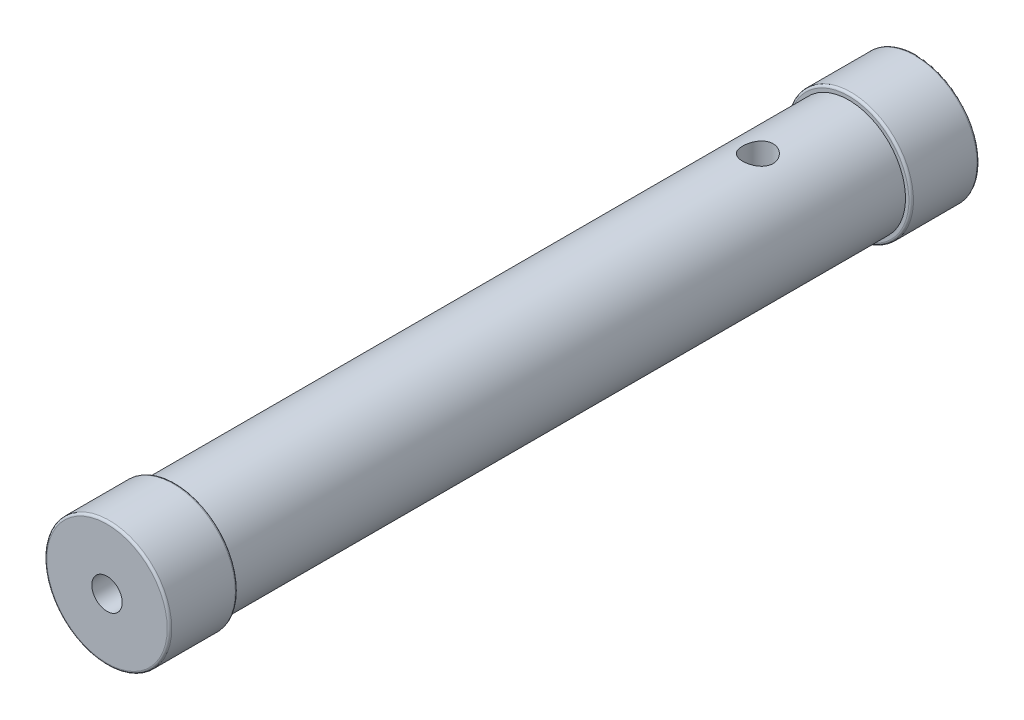
ISO-10303-21;
HEADER;
FILE_DESCRIPTION(('STEP AP214'),'2;1');
FILE_NAME('part.step','',(''),(''),'','','');
FILE_SCHEMA(('AUTOMOTIVE_DESIGN { 1 0 10303 214 1 1 1 1 }'));
ENDSEC;
DATA;
#1=APPLICATION_CONTEXT('core data for automotive mechanical design processes');
#2=APPLICATION_PROTOCOL_DEFINITION('international standard','automotive_design',2000,#1);
#3=PRODUCT_CONTEXT('',#1,'mechanical');
#4=PRODUCT('Part','Part','',(#3));
#5=PRODUCT_RELATED_PRODUCT_CATEGORY('part','',(#4));
#6=PRODUCT_DEFINITION_FORMATION('','',#4);
#7=PRODUCT_DEFINITION_CONTEXT('part definition',#1,'design');
#8=PRODUCT_DEFINITION('design','',#6,#7);
#9=PRODUCT_DEFINITION_SHAPE('','',#8);
#10=(LENGTH_UNIT() NAMED_UNIT(*) SI_UNIT(.MILLI.,.METRE.));
#11=(NAMED_UNIT(*) PLANE_ANGLE_UNIT() SI_UNIT($,.RADIAN.));
#12=(NAMED_UNIT(*) SI_UNIT($,.STERADIAN.) SOLID_ANGLE_UNIT());
#13=UNCERTAINTY_MEASURE_WITH_UNIT(LENGTH_MEASURE(1.E-05),#10,'distance_accuracy_value','');
#14=(GEOMETRIC_REPRESENTATION_CONTEXT(3) GLOBAL_UNCERTAINTY_ASSIGNED_CONTEXT((#13)) GLOBAL_UNIT_ASSIGNED_CONTEXT((#10,
#11,#12)) REPRESENTATION_CONTEXT('',''));
#15=CARTESIAN_POINT('',(0.,0.,0.));
#16=DIRECTION('',(0.,0.,1.));
#17=DIRECTION('',(1.,0.,0.));
#18=AXIS2_PLACEMENT_3D('',#15,#16,#17);
#19=CARTESIAN_POINT('',(0.,0.,356.5));
#20=DIRECTION('',(0.,0.,-1.));
#21=DIRECTION('',(-1.,0.,0.));
#22=AXIS2_PLACEMENT_3D('',#19,#20,#21);
#23=CYLINDRICAL_SURFACE('',#22,25.);
#24=CARTESIAN_POINT('',(0.,25.,76.7));
#25=CARTESIAN_POINT('',(-0.184700398279364,25.0000040720988,76.700006393712));
#26=CARTESIAN_POINT('',(-0.369334451472313,24.9979503284921,76.6923617389128));
#27=CARTESIAN_POINT('',(-0.737303476695323,24.9898016962233,76.6618642772237));
#28=CARTESIAN_POINT('',(-0.920638328865239,24.983706439486,76.6390100851454));
#29=CARTESIAN_POINT('',(-1.28466077898197,24.9676364441812,76.5782761663218));
#30=CARTESIAN_POINT('',(-1.46534776730316,24.9576608263476,76.5403930340721));
#31=CARTESIAN_POINT('',(-1.82282776438892,24.9341010354583,76.4499072578912));
#32=CARTESIAN_POINT('',(-1.99961931043949,24.9205155311015,76.3972991831206));
#33=CARTESIAN_POINT('',(-2.34772058974933,24.8901322850517,76.2778984834367));
#34=CARTESIAN_POINT('',(-2.51903910060402,24.873340023028,76.2111300343876));
#35=CARTESIAN_POINT('',(-2.85542584730583,24.836972051365,76.0638496614044));
#36=CARTESIAN_POINT('',(-3.02049174502907,24.8173953132501,75.9833326570831));
#37=CARTESIAN_POINT('',(-3.34319595911951,24.7759860880985,75.8091852596538));
#38=CARTESIAN_POINT('',(-3.50083673933327,24.754154357115,75.7155592580062));
#39=CARTESIAN_POINT('',(-3.80777974270735,24.708802743683,75.5158309120711));
#40=CARTESIAN_POINT('',(-3.95707874617589,24.6852822173019,75.4097237988255));
#41=CARTESIAN_POINT('',(-4.39699015505903,24.6121069470767,75.069091876205));
#42=CARTESIAN_POINT('',(-4.67309178126308,24.5607117336681,74.8157753436156));
#43=CARTESIAN_POINT('',(-5.17938418575683,24.4589651055811,74.2665546063954));
#44=CARTESIAN_POINT('',(-5.4095689906475,24.4086138274723,73.97064486935));
#45=CARTESIAN_POINT('',(-5.71746588757256,24.3376648683563,73.4981265668985));
#46=CARTESIAN_POINT('',(-5.81456743691813,24.3145919450013,73.3342361656786));
#47=CARTESIAN_POINT('',(-5.99456965401867,24.2708408632793,72.9985579415977));
#48=CARTESIAN_POINT('',(-6.07747588059889,24.2501617685319,72.826773243688));
#49=CARTESIAN_POINT('',(-6.22845655741341,24.2118236100558,72.4764358640483));
#50=CARTESIAN_POINT('',(-6.29652720215178,24.1941653214475,72.2978814595676));
#51=CARTESIAN_POINT('',(-6.41722109399713,24.1624330314738,71.9353920107844));
#52=CARTESIAN_POINT('',(-6.46985086999786,24.1483575155317,71.7514592768941));
#53=CARTESIAN_POINT('',(-6.55822942292211,24.1245036476564,71.3836869967675));
#54=CARTESIAN_POINT('',(-6.59433014685934,24.1146360462004,71.1999377767623));
#55=CARTESIAN_POINT('',(-6.65102828679536,24.0990599329375,70.8299587652205));
#56=CARTESIAN_POINT('',(-6.6716317810871,24.0933497905284,70.6437299754135));
#57=CARTESIAN_POINT('',(-6.697171050573,24.0862632304189,70.2701140201589));
#58=CARTESIAN_POINT('',(-6.70210643718457,24.0848869202013,70.0827268260974));
#59=CARTESIAN_POINT('',(-6.69626272106313,24.0865123111059,69.7082183979115));
#60=CARTESIAN_POINT('',(-6.68548387580273,24.0895139404971,69.5210971594798));
#61=CARTESIAN_POINT('',(-6.64884046550414,24.0996528392488,69.1538283290269));
#62=CARTESIAN_POINT('',(-6.62341300384836,24.1066702422553,68.9736336041696));
#63=CARTESIAN_POINT('',(-6.55802410816618,24.1245407695626,68.6160312187923));
#64=CARTESIAN_POINT('',(-6.51805770068844,24.1353952063918,68.4386245336886));
#65=CARTESIAN_POINT('',(-6.42393604384064,24.1606170298055,68.0879336690639));
#66=CARTESIAN_POINT('',(-6.36978513832381,24.1749833408257,67.9146482451407));
#67=CARTESIAN_POINT('',(-6.24769311060472,24.2068235977316,67.5732300096728));
#68=CARTESIAN_POINT('',(-6.17974680637353,24.2242987110846,67.4050991617621));
#69=CARTESIAN_POINT('',(-6.02976416787844,24.2620688823696,67.0733208338898));
#70=CARTESIAN_POINT('',(-5.94758106365839,24.2823928454214,66.9097430155415));
#71=CARTESIAN_POINT('',(-5.77021743588375,24.3251497619329,66.5900109638037));
#72=CARTESIAN_POINT('',(-5.67503244323203,24.3475834397284,66.4338593079746));
#73=CARTESIAN_POINT('',(-5.47233996912001,24.3939398062499,66.1300067300459));
#74=CARTESIAN_POINT('',(-5.36483254633806,24.4178624878851,65.98230576771));
#75=CARTESIAN_POINT('',(-5.13819700481798,24.4665559933736,65.6962538372849));
#76=CARTESIAN_POINT('',(-5.01906862605122,24.4913268361971,65.5579030785318));
#77=CARTESIAN_POINT('',(-4.76580622844742,24.5418888598484,65.2869748265201));
#78=CARTESIAN_POINT('',(-4.63130553183596,24.5676866301811,65.1547410770855));
#79=CARTESIAN_POINT('',(-4.35163118805883,24.6187632101253,64.9020779485146));
#80=CARTESIAN_POINT('',(-4.20646106513268,24.6440421876023,64.781644701926));
#81=CARTESIAN_POINT('',(-3.90628969098756,24.6934007456147,64.5533060635643));
#82=CARTESIAN_POINT('',(-3.75128436784584,24.7174798219094,64.4454059137089));
#83=CARTESIAN_POINT('',(-3.43257741561793,24.7637502545993,64.2430013654609));
#84=CARTESIAN_POINT('',(-3.2688791985992,24.7859423428926,64.148491763769));
#85=CARTESIAN_POINT('',(-2.93301389497084,24.8279319532666,63.9731024980498));
#86=CARTESIAN_POINT('',(-2.76080960008206,24.8477173454324,63.8922911303029));
#87=CARTESIAN_POINT('',(-2.40993700621777,24.8841977548536,63.7455335134102));
#88=CARTESIAN_POINT('',(-2.23127119459351,24.9008939464685,63.6795816133537));
#89=CARTESIAN_POINT('',(-1.86869710315141,24.9307251321014,63.5630573758879));
#90=CARTESIAN_POINT('',(-1.68478874864579,24.9438600753562,63.5124852577063));
#91=CARTESIAN_POINT('',(-1.31310253938385,24.9661854848872,63.42716835235));
#92=CARTESIAN_POINT('',(-1.1253247954901,24.97537606401,63.3924231123739));
#93=CARTESIAN_POINT('',(-0.752881901105318,24.9893351849549,63.3398577600791));
#94=CARTESIAN_POINT('',(-0.568287057891064,24.9942255504071,63.3215710026981));
#95=CARTESIAN_POINT('',(-0.198087235049676,24.9999008090489,63.3003622294096));
#96=CARTESIAN_POINT('',(-0.0124819275135959,25.0006842788278,63.2974455406187));
#97=CARTESIAN_POINT('',(0.358214908069406,24.9981203940095,63.3070153245491));
#98=CARTESIAN_POINT('',(0.543306635120264,24.9947749628491,63.3194946250909));
#99=CARTESIAN_POINT('',(0.911771099248296,24.9840480404169,63.3597415532902));
#100=CARTESIAN_POINT('',(1.09514317576283,24.9766650580054,63.3875148293118));
#101=CARTESIAN_POINT('',(1.45552977273023,24.9582333378258,63.4574831454733));
#102=CARTESIAN_POINT('',(1.63259936056688,24.9472521313114,63.4994129076726));
#103=CARTESIAN_POINT('',(1.98258001909425,24.9218813889187,63.5974681648232));
#104=CARTESIAN_POINT('',(2.15548957263592,24.9074906297385,63.6535987553336));
#105=CARTESIAN_POINT('',(2.49588592882454,24.8756863074903,63.7795915482038));
#106=CARTESIAN_POINT('',(2.66337421772654,24.8582735813755,63.8494499492653));
#107=CARTESIAN_POINT('',(2.99195779707744,24.8208691226753,64.002413576052));
#108=CARTESIAN_POINT('',(3.15305078778313,24.8008764731423,64.0855235140802));
#109=CARTESIAN_POINT('',(3.47085366910557,24.758420328352,64.2661331593526));
#110=CARTESIAN_POINT('',(3.6274163215964,24.7359161727212,64.3638823992054));
#111=CARTESIAN_POINT('',(3.9317964949485,24.6893638122867,64.5718371635367));
#112=CARTESIAN_POINT('',(4.07961379406798,24.6653155683643,64.6820430036511));
#113=CARTESIAN_POINT('',(4.36562716946965,24.6163027602544,64.9142122344012));
#114=CARTESIAN_POINT('',(4.50381999557972,24.5913378908286,65.0361795640374));
#115=CARTESIAN_POINT('',(4.76962534117674,24.5411687782452,65.2910125918579));
#116=CARTESIAN_POINT('',(4.8972412607777,24.5159646149391,65.4238747601866));
#117=CARTESIAN_POINT('',(5.14466800890223,24.4652570049811,65.7036911632353));
#118=CARTESIAN_POINT('',(5.26414647254304,24.4397659759511,65.8509417802315));
#119=CARTESIAN_POINT('',(5.49024015420077,24.3899705406741,66.1551124927217));
#120=CARTESIAN_POINT('',(5.59686001922046,24.3656657076466,66.3120290638513));
#121=CARTESIAN_POINT('',(5.79655995326237,24.3189312548554,66.6346042694545));
#122=CARTESIAN_POINT('',(5.88963500896428,24.2965023307188,66.8002661100419));
#123=CARTESIAN_POINT('',(6.06145802824069,24.2542069866262,67.139092403857));
#124=CARTESIAN_POINT('',(6.14021179829006,24.2343395290948,67.312253781028));
#125=CARTESIAN_POINT('',(6.28241871126045,24.1978630982411,67.6639774837481));
#126=CARTESIAN_POINT('',(6.34595280305107,24.1812369774326,67.8425052814424));
#127=CARTESIAN_POINT('',(6.4577155041855,24.1516304926587,68.2045113028312));
#128=CARTESIAN_POINT('',(6.50595008311741,24.1386487069687,68.3879875653312));
#129=CARTESIAN_POINT('',(6.58672096892668,24.1167340469047,68.7585996143771));
#130=CARTESIAN_POINT('',(6.61925762353519,24.1078010828439,68.9457353197655));
#131=CARTESIAN_POINT('',(6.66833482441991,24.0942723885285,69.3222465113918));
#132=CARTESIAN_POINT('',(6.68487582775746,24.089676534345,69.5116219334753));
#133=CARTESIAN_POINT('',(6.70152598038224,24.0850496914148,69.884816511595));
#134=CARTESIAN_POINT('',(6.7021645405981,24.0848716299475,70.0686104310687));
#135=CARTESIAN_POINT('',(6.68834408132313,24.08871323617,70.435650264814));
#136=CARTESIAN_POINT('',(6.67387987057909,24.0927343472353,70.6188959689291));
#137=CARTESIAN_POINT('',(6.62998184626829,24.1048513124306,70.9833722431411));
#138=CARTESIAN_POINT('',(6.60055402225761,24.1129455361833,71.1646035898976));
#139=CARTESIAN_POINT('',(6.52697147302902,24.1329669785103,71.5239042444901));
#140=CARTESIAN_POINT('',(6.48281126005915,24.1448956253305,71.7019723479598));
#141=CARTESIAN_POINT('',(6.38055912538605,24.1721169332805,72.0521859594746));
#142=CARTESIAN_POINT('',(6.32258551922374,24.1873809387301,72.2243682850425));
#143=CARTESIAN_POINT('',(6.19294807433535,24.2208974738671,72.563263579763));
#144=CARTESIAN_POINT('',(6.12127957215128,24.2391510212655,72.7299746630946));
#145=CARTESIAN_POINT('',(5.96479968163694,24.2781313468793,73.0567937158583));
#146=CARTESIAN_POINT('',(5.87998903955819,24.2988579846496,73.2169020595612));
#147=CARTESIAN_POINT('',(5.69781368404997,24.3422201705243,73.5295402690557));
#148=CARTESIAN_POINT('',(5.60044857425744,24.36485577889,73.6820698953654));
#149=CARTESIAN_POINT('',(5.39072188235647,24.4121283608373,73.9830590063949));
#150=CARTESIAN_POINT('',(5.27799917198776,24.4368049231737,74.1312607483058));
#151=CARTESIAN_POINT('',(5.04072050217011,24.4868501354198,74.4176587324611));
#152=CARTESIAN_POINT('',(4.91616825606724,24.512218566378,74.5558580906552));
#153=CARTESIAN_POINT('',(4.65593212167185,24.5629777588492,74.8215026451356));
#154=CARTESIAN_POINT('',(4.52024181146898,24.5883685247752,74.9489415501097));
#155=CARTESIAN_POINT('',(4.23870925670936,24.6384613161874,75.1921025869148));
#156=CARTESIAN_POINT('',(4.09287068718405,24.6631635865093,75.3078289233866));
#157=CARTESIAN_POINT('',(3.78859174937896,24.7117547511862,75.529263243397));
#158=CARTESIAN_POINT('',(3.62994409371068,24.7356135999423,75.6346932584951));
#159=CARTESIAN_POINT('',(3.30408889728364,24.7812439990952,75.8317441342591));
#160=CARTESIAN_POINT('',(3.13688452584755,24.8030163138621,75.9233700589347));
#161=CARTESIAN_POINT('',(2.79505618587902,24.8438575005938,76.0921232480192));
#162=CARTESIAN_POINT('',(2.62043487947401,24.8629273320681,76.1692556614965));
#163=CARTESIAN_POINT('',(2.26502150555481,24.8978234248941,76.308417034252));
#164=CARTESIAN_POINT('',(2.08423026157792,24.9136501171664,76.3704480002877));
#165=CARTESIAN_POINT('',(1.59352340845748,24.9510605627595,76.5156206370486));
#166=CARTESIAN_POINT('',(1.27903929447815,24.9692898002586,76.5846308294629));
#167=CARTESIAN_POINT('',(0.642969349294276,24.9937553710297,76.6768126356769));
#168=CARTESIAN_POINT('',(0.321384237989599,24.9999929144258,76.6999888747492));
#169=CARTESIAN_POINT('',(0.,25.,76.7));
#170=B_SPLINE_CURVE_WITH_KNOTS('',3,(#24,#25,#26,#27,#28,#29,#30,#31,#32,#33,#34,#35,#36,#37,
#38,#39,#40,#41,#42,#43,#44,#45,#46,#47,#48,#49,#50,#51,#52,#53,#54,#55,#56,#57,#58,#59,#60,#61,
#62,#63,#64,#65,#66,#67,#68,#69,#70,#71,#72,#73,#74,#75,#76,#77,#78,#79,#80,#81,#82,#83,#84,#85,
#86,#87,#88,#89,#90,#91,#92,#93,#94,#95,#96,#97,#98,#99,#100,#101,#102,#103,#104,#105,#106,#107,
#108,#109,#110,#111,#112,#113,#114,#115,#116,#117,#118,#119,#120,#121,#122,#123,#124,#125,#126,
#127,#128,#129,#130,#131,#132,#133,#134,#135,#136,#137,#138,#139,#140,#141,#142,#143,#144,#145,
#146,#147,#148,#149,#150,#151,#152,#153,#154,#155,#156,#157,#158,#159,#160,#161,#162,#163,#164,
#165,#166,#167,#168,#169),.UNSPECIFIED.,.T.,.F.,(4,2,2,2,2,2,2,2,2,2,2,2,2,2,2,2,2,2,2,2,2,2,2,
2,2,2,2,2,2,2,2,2,2,2,2,2,2,2,2,2,2,2,2,2,2,2,2,2,2,2,2,2,2,2,2,2,2,2,2,2,2,2,2,2,2,2,2,2,2,2,2,
2,4),(0.,0.553817557783857,1.10768556067305,1.66167913983917,2.21587731224757,2.76913681687448,
3.3226012069867,3.87588063043373,4.42937214958944,5.55847821711456,6.6877310763517,
7.26280556151458,7.83765433245224,8.41265038555795,8.98740296036032,9.54927236457848,
10.1109212784029,10.6725841214957,11.2342377620276,11.7799413280824,12.325831743048,
12.8715551798667,13.4174839898091,13.9694180655797,14.5215423355123,15.0736639763858,
15.6257979742786,16.1962471556127,16.7665087503249,17.3370080023358,17.9072849581595,
18.4803265019407,19.0531497543997,19.6259811716552,20.1987961993716,20.7548059209666,
21.3110083374632,21.8669517463913,22.4231006139223,22.9693583014592,23.5158122765612,
24.0621151485478,24.6086127232152,25.1657932190881,25.7229878364364,26.2803697143534,
26.8375717123967,27.4108846158146,27.9839897033361,28.5573063768122,29.1303900818679,
29.7003544631559,30.2700961804926,30.8398252766678,31.4095380928662,31.9602582016445,
32.5111676709703,33.0618567985472,33.6127512849372,34.1590868657336,34.7056088202009,
35.2520997528183,35.7986079431863,36.361443573716,36.9241031078157,37.4870893663393,
38.0498727987811,38.6250952675526,39.2001062002889,39.7749124626904,40.3496423001566,
41.3133987383052,42.2770579152844),.UNSPECIFIED.);
#171=CARTESIAN_POINT('',(0.,25.,76.7));
#172=VERTEX_POINT('',#171);
#173=EDGE_CURVE('E83',#172,#172,#170,.T.);
#174=ORIENTED_EDGE('',*,*,#173,.T.);
#175=EDGE_LOOP('',(#174));
#176=FACE_BOUND('',#175,.T.);
#177=CARTESIAN_POINT('',(0.,0.,326.5));
#178=DIRECTION('',(0.,0.,1.));
#179=DIRECTION('',(1.,0.,0.));
#180=AXIS2_PLACEMENT_3D('',#177,#178,#179);
#181=CIRCLE('',#180,25.);
#182=CARTESIAN_POINT('',(25.,0.,326.5));
#183=VERTEX_POINT('',#182);
#184=EDGE_CURVE('E153',#183,#183,#181,.T.);
#185=ORIENTED_EDGE('',*,*,#184,.F.);
#186=EDGE_LOOP('',(#185));
#187=FACE_BOUND('',#186,.T.);
#188=CARTESIAN_POINT('',(0.,0.,30.));
#189=DIRECTION('',(0.,0.,-1.));
#190=DIRECTION('',(-1.,0.,0.));
#191=AXIS2_PLACEMENT_3D('',#188,#189,#190);
#192=CIRCLE('',#191,25.);
#193=CARTESIAN_POINT('',(-25.,0.,30.));
#194=VERTEX_POINT('',#193);
#195=EDGE_CURVE('E92',#194,#194,#192,.T.);
#196=ORIENTED_EDGE('',*,*,#195,.F.);
#197=EDGE_LOOP('',(#196));
#198=FACE_BOUND('',#197,.T.);
#199=ADVANCED_FACE('F43',(#176,#187,#198),#23,.T.);
#200=CARTESIAN_POINT('',(0.,0.,326.5));
#201=DIRECTION('',(0.,0.,1.));
#202=DIRECTION('',(1.,0.,0.));
#203=AXIS2_PLACEMENT_3D('',#200,#201,#202);
#204=CYLINDRICAL_SURFACE('',#203,27.5);
#205=CARTESIAN_POINT('',(0.,0.,327.5));
#206=DIRECTION('',(0.,0.,1.));
#207=DIRECTION('',(1.,0.,0.));
#208=AXIS2_PLACEMENT_3D('',#205,#206,#207);
#209=CIRCLE('',#208,27.5);
#210=CARTESIAN_POINT('',(27.5,0.,327.5));
#211=VERTEX_POINT('',#210);
#212=EDGE_CURVE('E56',#211,#211,#209,.T.);
#213=ORIENTED_EDGE('',*,*,#212,.T.);
#214=EDGE_LOOP('',(#213));
#215=FACE_BOUND('',#214,.T.);
#216=CARTESIAN_POINT('',(0.,0.,355.5));
#217=DIRECTION('',(0.,0.,1.));
#218=DIRECTION('',(1.,0.,0.));
#219=AXIS2_PLACEMENT_3D('',#216,#217,#218);
#220=CIRCLE('',#219,27.5);
#221=CARTESIAN_POINT('',(27.5,0.,355.5));
#222=VERTEX_POINT('',#221);
#223=EDGE_CURVE('E61',#222,#222,#220,.F.);
#224=ORIENTED_EDGE('',*,*,#223,.T.);
#225=EDGE_LOOP('',(#224));
#226=FACE_BOUND('',#225,.T.);
#227=ADVANCED_FACE('F133',(#215,#226),#204,.T.);
#228=CARTESIAN_POINT('',(0.,0.,326.5));
#229=DIRECTION('',(0.,0.,1.));
#230=DIRECTION('',(1.,0.,0.));
#231=AXIS2_PLACEMENT_3D('',#228,#229,#230);
#232=PLANE('',#231);
#233=CARTESIAN_POINT('',(0.,0.,326.5));
#234=DIRECTION('',(0.,0.,1.));
#235=DIRECTION('',(1.,0.,0.));
#236=AXIS2_PLACEMENT_3D('',#233,#234,#235);
#237=CIRCLE('',#236,26.5);
#238=CARTESIAN_POINT('',(26.5,0.,326.5));
#239=VERTEX_POINT('',#238);
#240=EDGE_CURVE('E51',#239,#239,#237,.F.);
#241=ORIENTED_EDGE('',*,*,#240,.T.);
#242=EDGE_LOOP('',(#241));
#243=FACE_BOUND('',#242,.T.);
#244=ORIENTED_EDGE('',*,*,#184,.T.);
#245=EDGE_LOOP('',(#244));
#246=FACE_BOUND('',#245,.T.);
#247=ADVANCED_FACE('F130',(#243,#246),#232,.F.);
#248=CARTESIAN_POINT('',(0.,0.,356.5));
#249=DIRECTION('',(0.,0.,1.));
#250=DIRECTION('',(1.,0.,0.));
#251=AXIS2_PLACEMENT_3D('',#248,#249,#250);
#252=PLANE('',#251);
#253=CARTESIAN_POINT('',(0.,0.,356.5));
#254=DIRECTION('',(0.,0.,1.));
#255=DIRECTION('',(1.,0.,0.));
#256=AXIS2_PLACEMENT_3D('',#253,#254,#255);
#257=CIRCLE('',#256,26.5);
#258=CARTESIAN_POINT('',(26.5,0.,356.5));
#259=VERTEX_POINT('',#258);
#260=EDGE_CURVE('E10',#259,#259,#257,.T.);
#261=ORIENTED_EDGE('',*,*,#260,.T.);
#262=EDGE_LOOP('',(#261));
#263=FACE_BOUND('',#262,.T.);
#264=CARTESIAN_POINT('',(0.,0.,356.5));
#265=DIRECTION('',(0.,0.,1.));
#266=DIRECTION('',(1.,0.,0.));
#267=AXIS2_PLACEMENT_3D('',#264,#265,#266);
#268=CIRCLE('',#267,6.7);
#269=CARTESIAN_POINT('',(6.7,0.,356.5));
#270=VERTEX_POINT('',#269);
#271=EDGE_CURVE('E170',#270,#270,#268,.T.);
#272=ORIENTED_EDGE('',*,*,#271,.F.);
#273=EDGE_LOOP('',(#272));
#274=FACE_BOUND('',#273,.T.);
#275=ADVANCED_FACE('F128',(#263,#274),#252,.T.);
#276=CARTESIAN_POINT('',(0.,0.,30.));
#277=DIRECTION('',(0.,0.,-1.));
#278=DIRECTION('',(-1.,0.,0.));
#279=AXIS2_PLACEMENT_3D('',#276,#277,#278);
#280=CYLINDRICAL_SURFACE('',#279,27.5);
#281=CARTESIAN_POINT('',(0.,0.,29.));
#282=DIRECTION('',(0.,0.,-1.));
#283=DIRECTION('',(-1.,0.,0.));
#284=AXIS2_PLACEMENT_3D('',#281,#282,#283);
#285=CIRCLE('',#284,27.5);
#286=CARTESIAN_POINT('',(-27.5,0.,29.));
#287=VERTEX_POINT('',#286);
#288=EDGE_CURVE('E75',#287,#287,#285,.T.);
#289=ORIENTED_EDGE('',*,*,#288,.T.);
#290=EDGE_LOOP('',(#289));
#291=FACE_BOUND('',#290,.T.);
#292=CARTESIAN_POINT('',(0.,0.,1.));
#293=DIRECTION('',(0.,0.,1.));
#294=DIRECTION('',(1.,0.,0.));
#295=AXIS2_PLACEMENT_3D('',#292,#293,#294);
#296=CIRCLE('',#295,27.5);
#297=CARTESIAN_POINT('',(27.5,0.,1.));
#298=VERTEX_POINT('',#297);
#299=EDGE_CURVE('E79',#298,#298,#296,.T.);
#300=ORIENTED_EDGE('',*,*,#299,.T.);
#301=EDGE_LOOP('',(#300));
#302=FACE_BOUND('',#301,.T.);
#303=ADVANCED_FACE('F124',(#291,#302),#280,.T.);
#304=CARTESIAN_POINT('',(0.,0.,30.));
#305=DIRECTION('',(0.,0.,-1.));
#306=DIRECTION('',(-1.,0.,0.));
#307=AXIS2_PLACEMENT_3D('',#304,#305,#306);
#308=PLANE('',#307);
#309=CARTESIAN_POINT('',(0.,0.,30.));
#310=DIRECTION('',(0.,0.,-1.));
#311=DIRECTION('',(-1.,0.,0.));
#312=AXIS2_PLACEMENT_3D('',#309,#310,#311);
#313=CIRCLE('',#312,26.5);
#314=CARTESIAN_POINT('',(-26.5,0.,30.));
#315=VERTEX_POINT('',#314);
#316=EDGE_CURVE('E71',#315,#315,#313,.F.);
#317=ORIENTED_EDGE('',*,*,#316,.T.);
#318=EDGE_LOOP('',(#317));
#319=FACE_BOUND('',#318,.T.);
#320=ORIENTED_EDGE('',*,*,#195,.T.);
#321=EDGE_LOOP('',(#320));
#322=FACE_BOUND('',#321,.T.);
#323=ADVANCED_FACE('F121',(#319,#322),#308,.F.);
#324=CARTESIAN_POINT('',(0.,0.,0.));
#325=DIRECTION('',(0.,0.,1.));
#326=DIRECTION('',(1.,0.,0.));
#327=AXIS2_PLACEMENT_3D('',#324,#325,#326);
#328=PLANE('',#327);
#329=CARTESIAN_POINT('',(0.,0.,0.));
#330=DIRECTION('',(0.,0.,1.));
#331=DIRECTION('',(1.,0.,0.));
#332=AXIS2_PLACEMENT_3D('',#329,#330,#331);
#333=CIRCLE('',#332,26.5);
#334=CARTESIAN_POINT('',(26.5,0.,0.));
#335=VERTEX_POINT('',#334);
#336=EDGE_CURVE('E67',#335,#335,#333,.F.);
#337=ORIENTED_EDGE('',*,*,#336,.T.);
#338=EDGE_LOOP('',(#337));
#339=FACE_BOUND('',#338,.T.);
#340=CARTESIAN_POINT('',(0.,0.,0.));
#341=DIRECTION('',(0.,0.,-1.));
#342=DIRECTION('',(-1.,0.,0.));
#343=AXIS2_PLACEMENT_3D('',#340,#341,#342);
#344=CIRCLE('',#343,6.7);
#345=CARTESIAN_POINT('',(-6.7,0.,0.));
#346=VERTEX_POINT('',#345);
#347=EDGE_CURVE('E163',#346,#346,#344,.T.);
#348=ORIENTED_EDGE('',*,*,#347,.F.);
#349=EDGE_LOOP('',(#348));
#350=FACE_BOUND('',#349,.T.);
#351=ADVANCED_FACE('F119',(#339,#350),#328,.F.);
#352=CARTESIAN_POINT('',(0.,0.,20.));
#353=DIRECTION('',(0.,0.,-1.));
#354=DIRECTION('',(-1.,0.,0.));
#355=AXIS2_PLACEMENT_3D('',#352,#353,#354);
#356=CYLINDRICAL_SURFACE('',#355,6.7);
#357=CARTESIAN_POINT('',(0.,0.,20.));
#358=DIRECTION('',(0.,0.,-1.));
#359=DIRECTION('',(-1.,0.,0.));
#360=AXIS2_PLACEMENT_3D('',#357,#358,#359);
#361=CIRCLE('',#360,6.7);
#362=CARTESIAN_POINT('',(-6.7,0.,20.));
#363=VERTEX_POINT('',#362);
#364=EDGE_CURVE('E159',#363,#363,#361,.T.);
#365=ORIENTED_EDGE('',*,*,#364,.F.);
#366=EDGE_LOOP('',(#365));
#367=FACE_BOUND('',#366,.T.);
#368=ORIENTED_EDGE('',*,*,#347,.T.);
#369=EDGE_LOOP('',(#368));
#370=FACE_BOUND('',#369,.T.);
#371=ADVANCED_FACE('F115',(#367,#370),#356,.F.);
#372=CARTESIAN_POINT('',(0.,0.,20.));
#373=DIRECTION('',(0.,0.,-1.));
#374=DIRECTION('',(-1.,0.,0.));
#375=AXIS2_PLACEMENT_3D('',#372,#373,#374);
#376=PLANE('',#375);
#377=ORIENTED_EDGE('',*,*,#364,.T.);
#378=EDGE_LOOP('',(#377));
#379=FACE_BOUND('',#378,.T.);
#380=ADVANCED_FACE('F111',(#379),#376,.T.);
#381=CARTESIAN_POINT('',(0.,0.,336.5));
#382=DIRECTION('',(0.,0.,1.));
#383=DIRECTION('',(1.,0.,0.));
#384=AXIS2_PLACEMENT_3D('',#381,#382,#383);
#385=CYLINDRICAL_SURFACE('',#384,6.7);
#386=CARTESIAN_POINT('',(0.,0.,336.5));
#387=DIRECTION('',(0.,0.,1.));
#388=DIRECTION('',(1.,0.,0.));
#389=AXIS2_PLACEMENT_3D('',#386,#387,#388);
#390=CIRCLE('',#389,6.7);
#391=CARTESIAN_POINT('',(6.7,0.,336.5));
#392=VERTEX_POINT('',#391);
#393=EDGE_CURVE('E168',#392,#392,#390,.T.);
#394=ORIENTED_EDGE('',*,*,#393,.F.);
#395=EDGE_LOOP('',(#394));
#396=FACE_BOUND('',#395,.T.);
#397=ORIENTED_EDGE('',*,*,#271,.T.);
#398=EDGE_LOOP('',(#397));
#399=FACE_BOUND('',#398,.T.);
#400=ADVANCED_FACE('F107',(#396,#399),#385,.F.);
#401=CARTESIAN_POINT('',(0.,0.,336.5));
#402=DIRECTION('',(0.,0.,1.));
#403=DIRECTION('',(1.,0.,0.));
#404=AXIS2_PLACEMENT_3D('',#401,#402,#403);
#405=PLANE('',#404);
#406=ORIENTED_EDGE('',*,*,#393,.T.);
#407=EDGE_LOOP('',(#406));
#408=FACE_BOUND('',#407,.T.);
#409=ADVANCED_FACE('F103',(#408),#405,.T.);
#410=CARTESIAN_POINT('',(0.,5.,70.));
#411=DIRECTION('',(0.,1.,0.));
#412=DIRECTION('',(0.,0.,1.));
#413=AXIS2_PLACEMENT_3D('',#410,#411,#412);
#414=CYLINDRICAL_SURFACE('',#413,6.7);
#415=CARTESIAN_POINT('',(0.,5.,70.));
#416=DIRECTION('',(0.,1.,0.));
#417=DIRECTION('',(0.,0.,1.));
#418=AXIS2_PLACEMENT_3D('',#415,#416,#417);
#419=CIRCLE('',#418,6.7);
#420=CARTESIAN_POINT('',(0.,5.,76.7));
#421=VERTEX_POINT('',#420);
#422=EDGE_CURVE('E174',#421,#421,#419,.T.);
#423=ORIENTED_EDGE('',*,*,#422,.F.);
#424=EDGE_LOOP('',(#423));
#425=FACE_BOUND('',#424,.T.);
#426=ORIENTED_EDGE('',*,*,#173,.F.);
#427=EDGE_LOOP('',(#426));
#428=FACE_BOUND('',#427,.T.);
#429=ADVANCED_FACE('F97',(#425,#428),#414,.F.);
#430=CARTESIAN_POINT('',(0.,5.,70.));
#431=DIRECTION('',(0.,1.,0.));
#432=DIRECTION('',(0.,0.,1.));
#433=AXIS2_PLACEMENT_3D('',#430,#431,#432);
#434=PLANE('',#433);
#435=ORIENTED_EDGE('',*,*,#422,.T.);
#436=EDGE_LOOP('',(#435));
#437=FACE_BOUND('',#436,.T.);
#438=ADVANCED_FACE('F102',(#437),#434,.T.);
#439=CARTESIAN_POINT('',(0.,0.,29.));
#440=DIRECTION('',(0.,0.,-1.));
#441=DIRECTION('',(-1.,0.,0.));
#442=AXIS2_PLACEMENT_3D('',#439,#440,#441);
#443=TOROIDAL_SURFACE('',#442,26.5,1.);
#444=ORIENTED_EDGE('',*,*,#316,.F.);
#445=EDGE_LOOP('',(#444));
#446=FACE_BOUND('',#445,.T.);
#447=ORIENTED_EDGE('',*,*,#288,.F.);
#448=EDGE_LOOP('',(#447));
#449=FACE_BOUND('',#448,.T.);
#450=ADVANCED_FACE('F184',(#446,#449),#443,.T.);
#451=CARTESIAN_POINT('',(0.,0.,1.));
#452=DIRECTION('',(0.,0.,1.));
#453=DIRECTION('',(1.,0.,0.));
#454=AXIS2_PLACEMENT_3D('',#451,#452,#453);
#455=TOROIDAL_SURFACE('',#454,26.5,1.);
#456=ORIENTED_EDGE('',*,*,#299,.F.);
#457=EDGE_LOOP('',(#456));
#458=FACE_BOUND('',#457,.T.);
#459=ORIENTED_EDGE('',*,*,#336,.F.);
#460=EDGE_LOOP('',(#459));
#461=FACE_BOUND('',#460,.T.);
#462=ADVANCED_FACE('F187',(#458,#461),#455,.T.);
#463=CARTESIAN_POINT('',(0.,0.,327.5));
#464=DIRECTION('',(0.,0.,1.));
#465=DIRECTION('',(1.,0.,0.));
#466=AXIS2_PLACEMENT_3D('',#463,#464,#465);
#467=TOROIDAL_SURFACE('',#466,26.5,1.);
#468=ORIENTED_EDGE('',*,*,#240,.F.);
#469=EDGE_LOOP('',(#468));
#470=FACE_BOUND('',#469,.T.);
#471=ORIENTED_EDGE('',*,*,#212,.F.);
#472=EDGE_LOOP('',(#471));
#473=FACE_BOUND('',#472,.T.);
#474=ADVANCED_FACE('F192',(#470,#473),#467,.T.);
#475=CARTESIAN_POINT('',(0.,0.,355.5));
#476=DIRECTION('',(0.,0.,1.));
#477=DIRECTION('',(1.,0.,0.));
#478=AXIS2_PLACEMENT_3D('',#475,#476,#477);
#479=TOROIDAL_SURFACE('',#478,26.5,1.);
#480=ORIENTED_EDGE('',*,*,#223,.F.);
#481=EDGE_LOOP('',(#480));
#482=FACE_BOUND('',#481,.T.);
#483=ORIENTED_EDGE('',*,*,#260,.F.);
#484=EDGE_LOOP('',(#483));
#485=FACE_BOUND('',#484,.T.);
#486=ADVANCED_FACE('F45',(#482,#485),#479,.T.);
#487=CLOSED_SHELL('',(#199,#227,#247,#275,#303,#323,#351,#371,#380,#400,#409,#429,#438,#450,
#462,#474,#486));
#488=MANIFOLD_SOLID_BREP('B2',#487);
#489=ADVANCED_BREP_SHAPE_REPRESENTATION('',(#18,#488),#14);
#490=SHAPE_DEFINITION_REPRESENTATION(#9,#489);
ENDSEC;
END-ISO-10303-21;
